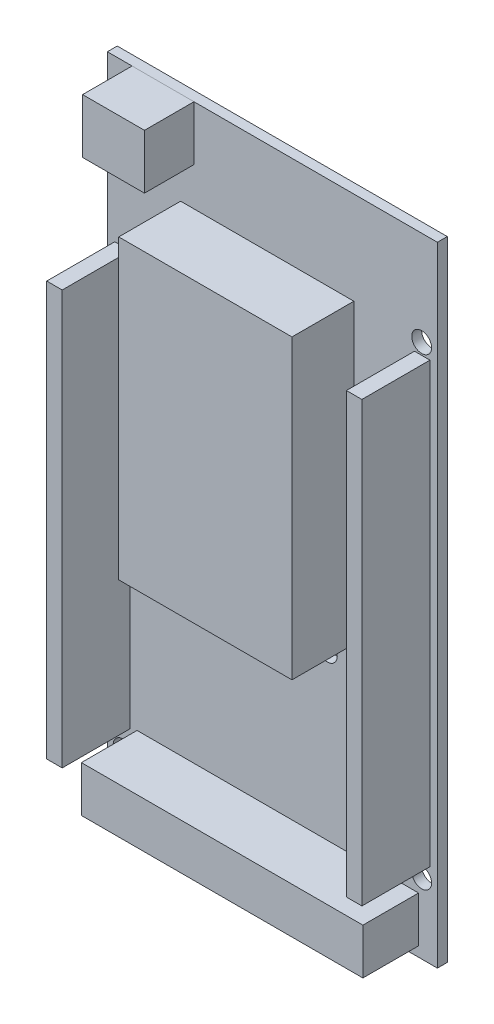
ISO-10303-21;
HEADER;
FILE_DESCRIPTION(('STEP AP214'),'2;1');
FILE_NAME('part.step','',(''),(''),'','','');
FILE_SCHEMA(('AUTOMOTIVE_DESIGN { 1 0 10303 214 1 1 1 1 }'));
ENDSEC;
DATA;
#1=APPLICATION_CONTEXT('core data for automotive mechanical design processes');
#2=APPLICATION_PROTOCOL_DEFINITION('international standard','automotive_design',2000,#1);
#3=PRODUCT_CONTEXT('',#1,'mechanical');
#4=PRODUCT('Part','Part','',(#3));
#5=PRODUCT_RELATED_PRODUCT_CATEGORY('part','',(#4));
#6=PRODUCT_DEFINITION_FORMATION('','',#4);
#7=PRODUCT_DEFINITION_CONTEXT('part definition',#1,'design');
#8=PRODUCT_DEFINITION('design','',#6,#7);
#9=PRODUCT_DEFINITION_SHAPE('','',#8);
#10=(LENGTH_UNIT() NAMED_UNIT(*) SI_UNIT(.MILLI.,.METRE.));
#11=(NAMED_UNIT(*) PLANE_ANGLE_UNIT() SI_UNIT($,.RADIAN.));
#12=(NAMED_UNIT(*) SI_UNIT($,.STERADIAN.) SOLID_ANGLE_UNIT());
#13=UNCERTAINTY_MEASURE_WITH_UNIT(LENGTH_MEASURE(1.E-05),#10,'distance_accuracy_value','');
#14=(GEOMETRIC_REPRESENTATION_CONTEXT(3) GLOBAL_UNCERTAINTY_ASSIGNED_CONTEXT((#13)) GLOBAL_UNIT_ASSIGNED_CONTEXT((#10,
#11,#12)) REPRESENTATION_CONTEXT('',''));
#15=CARTESIAN_POINT('',(0.,0.,0.));
#16=DIRECTION('',(0.,0.,1.));
#17=DIRECTION('',(1.,0.,0.));
#18=AXIS2_PLACEMENT_3D('',#15,#16,#17);
#19=CARTESIAN_POINT('',(-12.67,50.8,9.6));
#20=DIRECTION('',(-1.,0.,0.));
#21=DIRECTION('',(0.,-1.,0.));
#22=AXIS2_PLACEMENT_3D('',#19,#20,#21);
#23=PLANE('',#22);
#24=DIRECTION('',(0.,1.,0.));
#25=VECTOR('',#24,1.);
#26=CARTESIAN_POINT('',(-12.67,50.8,1.6));
#27=LINE('',#26,#25);
#28=CARTESIAN_POINT('',(-12.67,42.,1.6));
#29=VERTEX_POINT('',#28);
#30=CARTESIAN_POINT('',(-12.67,50.8,1.6));
#31=VERTEX_POINT('',#30);
#32=EDGE_CURVE('E106',#29,#31,#27,.T.);
#33=ORIENTED_EDGE('',*,*,#32,.T.);
#34=DIRECTION('',(0.,0.,-1.));
#35=VECTOR('',#34,1.);
#36=CARTESIAN_POINT('',(-12.67,50.8,9.6));
#37=LINE('',#36,#35);
#38=CARTESIAN_POINT('',(-12.67,50.8,9.6));
#39=VERTEX_POINT('',#38);
#40=EDGE_CURVE('E12',#39,#31,#37,.T.);
#41=ORIENTED_EDGE('',*,*,#40,.F.);
#42=DIRECTION('',(0.,1.,0.));
#43=VECTOR('',#42,1.);
#44=CARTESIAN_POINT('',(-12.67,50.8,9.6));
#45=LINE('',#44,#43);
#46=CARTESIAN_POINT('',(-12.67,42.,9.6));
#47=VERTEX_POINT('',#46);
#48=EDGE_CURVE('E94',#47,#39,#45,.T.);
#49=ORIENTED_EDGE('',*,*,#48,.F.);
#50=DIRECTION('',(0.,0.,-1.));
#51=VECTOR('',#50,1.);
#52=CARTESIAN_POINT('',(-12.67,42.,9.6));
#53=LINE('',#52,#51);
#54=EDGE_CURVE('E102',#47,#29,#53,.T.);
#55=ORIENTED_EDGE('',*,*,#54,.T.);
#56=EDGE_LOOP('',(#33,#41,#49,#55));
#57=FACE_BOUND('',#56,.T.);
#58=ADVANCED_FACE('F43',(#57),#23,.F.);
#59=CARTESIAN_POINT('',(-12.67,50.8,9.6));
#60=DIRECTION('',(0.,-1.,0.));
#61=DIRECTION('',(0.,0.,-1.));
#62=AXIS2_PLACEMENT_3D('',#59,#60,#61);
#63=PLANE('',#62);
#64=DIRECTION('',(-1.,0.,0.));
#65=VECTOR('',#64,1.);
#66=CARTESIAN_POINT('',(-12.67,50.8,1.6));
#67=LINE('',#66,#65);
#68=CARTESIAN_POINT('',(-22.67,50.8,1.6));
#69=VERTEX_POINT('',#68);
#70=EDGE_CURVE('E98',#31,#69,#67,.T.);
#71=ORIENTED_EDGE('',*,*,#70,.T.);
#72=DIRECTION('',(0.,0.,-1.));
#73=VECTOR('',#72,1.);
#74=CARTESIAN_POINT('',(-22.67,50.8,9.6));
#75=LINE('',#74,#73);
#76=CARTESIAN_POINT('',(-22.67,50.8,9.6));
#77=VERTEX_POINT('',#76);
#78=EDGE_CURVE('E51',#77,#69,#75,.T.);
#79=ORIENTED_EDGE('',*,*,#78,.F.);
#80=DIRECTION('',(-1.,0.,0.));
#81=VECTOR('',#80,1.);
#82=CARTESIAN_POINT('',(-12.67,50.8,9.6));
#83=LINE('',#82,#81);
#84=EDGE_CURVE('E89',#39,#77,#83,.T.);
#85=ORIENTED_EDGE('',*,*,#84,.F.);
#86=ORIENTED_EDGE('',*,*,#40,.T.);
#87=EDGE_LOOP('',(#71,#79,#85,#86));
#88=FACE_BOUND('',#87,.T.);
#89=ADVANCED_FACE('F97',(#88),#63,.F.);
#90=CARTESIAN_POINT('',(-22.67,50.8,9.6));
#91=DIRECTION('',(1.,0.,0.));
#92=DIRECTION('',(0.,0.,-1.));
#93=AXIS2_PLACEMENT_3D('',#90,#91,#92);
#94=PLANE('',#93);
#95=DIRECTION('',(0.,-1.,0.));
#96=VECTOR('',#95,1.);
#97=CARTESIAN_POINT('',(-22.67,50.8,1.6));
#98=LINE('',#97,#96);
#99=CARTESIAN_POINT('',(-22.67,42.,1.6));
#100=VERTEX_POINT('',#99);
#101=EDGE_CURVE('E76',#69,#100,#98,.T.);
#102=ORIENTED_EDGE('',*,*,#101,.T.);
#103=DIRECTION('',(0.,0.,-1.));
#104=VECTOR('',#103,1.);
#105=CARTESIAN_POINT('',(-22.67,42.,9.6));
#106=LINE('',#105,#104);
#107=CARTESIAN_POINT('',(-22.67,42.,9.6));
#108=VERTEX_POINT('',#107);
#109=EDGE_CURVE('E99',#108,#100,#106,.T.);
#110=ORIENTED_EDGE('',*,*,#109,.F.);
#111=DIRECTION('',(0.,-1.,0.));
#112=VECTOR('',#111,1.);
#113=CARTESIAN_POINT('',(-22.67,50.8,9.6));
#114=LINE('',#113,#112);
#115=EDGE_CURVE('E92',#77,#108,#114,.T.);
#116=ORIENTED_EDGE('',*,*,#115,.F.);
#117=ORIENTED_EDGE('',*,*,#78,.T.);
#118=EDGE_LOOP('',(#102,#110,#116,#117));
#119=FACE_BOUND('',#118,.T.);
#120=ADVANCED_FACE('F100',(#119),#94,.F.);
#121=CARTESIAN_POINT('',(-12.67,42.,9.6));
#122=DIRECTION('',(0.,1.,0.));
#123=DIRECTION('',(0.,0.,1.));
#124=AXIS2_PLACEMENT_3D('',#121,#122,#123);
#125=PLANE('',#124);
#126=DIRECTION('',(1.,0.,0.));
#127=VECTOR('',#126,1.);
#128=CARTESIAN_POINT('',(-12.67,42.,1.6));
#129=LINE('',#128,#127);
#130=EDGE_CURVE('E82',#100,#29,#129,.T.);
#131=ORIENTED_EDGE('',*,*,#130,.T.);
#132=ORIENTED_EDGE('',*,*,#54,.F.);
#133=DIRECTION('',(1.,0.,0.));
#134=VECTOR('',#133,1.);
#135=CARTESIAN_POINT('',(-12.67,42.,9.6));
#136=LINE('',#135,#134);
#137=EDGE_CURVE('E59',#108,#47,#136,.T.);
#138=ORIENTED_EDGE('',*,*,#137,.F.);
#139=ORIENTED_EDGE('',*,*,#109,.T.);
#140=EDGE_LOOP('',(#131,#132,#138,#139));
#141=FACE_BOUND('',#140,.T.);
#142=ADVANCED_FACE('F113',(#141),#125,.F.);
#143=CARTESIAN_POINT('',(0.,0.,9.6));
#144=DIRECTION('',(0.,0.,-1.));
#145=DIRECTION('',(-1.,0.,0.));
#146=AXIS2_PLACEMENT_3D('',#143,#144,#145);
#147=PLANE('',#146);
#148=ORIENTED_EDGE('',*,*,#48,.T.);
#149=ORIENTED_EDGE('',*,*,#84,.T.);
#150=ORIENTED_EDGE('',*,*,#115,.T.);
#151=ORIENTED_EDGE('',*,*,#137,.T.);
#152=EDGE_LOOP('',(#148,#149,#150,#151));
#153=FACE_BOUND('',#152,.T.);
#154=ADVANCED_FACE('F90',(#153),#147,.F.);
#155=CARTESIAN_POINT('',(0.,0.,1.6));
#156=DIRECTION('',(0.,0.,-1.));
#157=DIRECTION('',(-1.,0.,0.));
#158=AXIS2_PLACEMENT_3D('',#155,#156,#157);
#159=PLANE('',#158);
#160=ORIENTED_EDGE('',*,*,#32,.F.);
#161=ORIENTED_EDGE('',*,*,#130,.F.);
#162=ORIENTED_EDGE('',*,*,#101,.F.);
#163=ORIENTED_EDGE('',*,*,#70,.F.);
#164=EDGE_LOOP('',(#160,#161,#162,#163));
#165=FACE_BOUND('',#164,.T.);
#166=ADVANCED_FACE('F116',(#165),#159,.T.);
#167=CLOSED_SHELL('',(#58,#89,#120,#142,#154,#166));
#168=MANIFOLD_SOLID_BREP('B2',#167);
#169=CARTESIAN_POINT('',(0.,0.,1.6));
#170=DIRECTION('',(0.,0.,1.));
#171=DIRECTION('',(1.,0.,0.));
#172=AXIS2_PLACEMENT_3D('',#169,#170,#171);
#173=PLANE('',#172);
#174=CARTESIAN_POINT('',(24.13,-39.37,1.6));
#175=DIRECTION('',(0.,0.,1.));
#176=DIRECTION('',(1.,0.,0.));
#177=AXIS2_PLACEMENT_3D('',#174,#175,#176);
#178=CIRCLE('',#177,1.59999999999999);
#179=CARTESIAN_POINT('',(25.73,-39.37,1.6));
#180=VERTEX_POINT('',#179);
#181=EDGE_CURVE('E330',#180,#180,#178,.T.);
#182=ORIENTED_EDGE('',*,*,#181,.F.);
#183=EDGE_LOOP('',(#182));
#184=FACE_BOUND('',#183,.T.);
#185=CARTESIAN_POINT('',(-24.13,-45.72,1.6));
#186=DIRECTION('',(0.,0.,1.));
#187=DIRECTION('',(1.,0.,0.));
#188=AXIS2_PLACEMENT_3D('',#185,#186,#187);
#189=CIRCLE('',#188,1.59999999999999);
#190=CARTESIAN_POINT('',(-22.53,-45.72,1.6));
#191=VERTEX_POINT('',#190);
#192=EDGE_CURVE('E340',#191,#191,#189,.T.);
#193=ORIENTED_EDGE('',*,*,#192,.F.);
#194=EDGE_LOOP('',(#193));
#195=FACE_BOUND('',#194,.T.);
#196=CARTESIAN_POINT('',(-19.05,-15.24,1.6));
#197=DIRECTION('',(0.,0.,1.));
#198=DIRECTION('',(1.,0.,0.));
#199=AXIS2_PLACEMENT_3D('',#196,#197,#198);
#200=CIRCLE('',#199,1.59999999999999);
#201=CARTESIAN_POINT('',(-17.45,-15.24,1.6));
#202=VERTEX_POINT('',#201);
#203=EDGE_CURVE('E346',#202,#202,#200,.T.);
#204=ORIENTED_EDGE('',*,*,#203,.F.);
#205=EDGE_LOOP('',(#204));
#206=FACE_BOUND('',#205,.T.);
#207=CARTESIAN_POINT('',(8.89000000000001,-15.24,1.6));
#208=DIRECTION('',(0.,0.,1.));
#209=DIRECTION('',(1.,0.,0.));
#210=AXIS2_PLACEMENT_3D('',#207,#208,#209);
#211=CIRCLE('',#210,1.59999999999999);
#212=CARTESIAN_POINT('',(10.49,-15.24,1.6));
#213=VERTEX_POINT('',#212);
#214=EDGE_CURVE('E352',#213,#213,#211,.T.);
#215=ORIENTED_EDGE('',*,*,#214,.F.);
#216=EDGE_LOOP('',(#215));
#217=FACE_BOUND('',#216,.T.);
#218=CARTESIAN_POINT('',(-24.13,36.83,1.6));
#219=DIRECTION('',(0.,0.,1.));
#220=DIRECTION('',(1.,0.,0.));
#221=AXIS2_PLACEMENT_3D('',#218,#219,#220);
#222=CIRCLE('',#221,1.59999999999999);
#223=CARTESIAN_POINT('',(-22.53,36.83,1.6));
#224=VERTEX_POINT('',#223);
#225=EDGE_CURVE('E358',#224,#224,#222,.T.);
#226=ORIENTED_EDGE('',*,*,#225,.F.);
#227=EDGE_LOOP('',(#226));
#228=FACE_BOUND('',#227,.T.);
#229=CARTESIAN_POINT('',(24.13,35.56,1.6));
#230=DIRECTION('',(0.,0.,1.));
#231=DIRECTION('',(1.,0.,0.));
#232=AXIS2_PLACEMENT_3D('',#229,#230,#231);
#233=CIRCLE('',#232,1.59999999999999);
#234=CARTESIAN_POINT('',(25.73,35.56,1.6));
#235=VERTEX_POINT('',#234);
#236=EDGE_CURVE('E364',#235,#235,#233,.T.);
#237=ORIENTED_EDGE('',*,*,#236,.F.);
#238=EDGE_LOOP('',(#237));
#239=FACE_BOUND('',#238,.T.);
#240=DIRECTION('',(0.,-1.,0.));
#241=VECTOR('',#240,1.);
#242=CARTESIAN_POINT('',(-26.67,-50.8,1.6));
#243=LINE('',#242,#241);
#244=CARTESIAN_POINT('',(-26.67,50.8,1.6));
#245=VERTEX_POINT('',#244);
#246=CARTESIAN_POINT('',(-26.67,-50.8,1.6));
#247=VERTEX_POINT('',#246);
#248=EDGE_CURVE('E456',#245,#247,#243,.T.);
#249=ORIENTED_EDGE('',*,*,#248,.T.);
#250=DIRECTION('',(1.,0.,0.));
#251=VECTOR('',#250,1.);
#252=CARTESIAN_POINT('',(26.67,-50.8,1.6));
#253=LINE('',#252,#251);
#254=CARTESIAN_POINT('',(26.67,-50.8,1.6));
#255=VERTEX_POINT('',#254);
#256=EDGE_CURVE('E459',#247,#255,#253,.T.);
#257=ORIENTED_EDGE('',*,*,#256,.T.);
#258=DIRECTION('',(0.,1.,0.));
#259=VECTOR('',#258,1.);
#260=CARTESIAN_POINT('',(26.67,-50.8,1.6));
#261=LINE('',#260,#259);
#262=CARTESIAN_POINT('',(26.67,50.8,1.6));
#263=VERTEX_POINT('',#262);
#264=EDGE_CURVE('E462',#255,#263,#261,.T.);
#265=ORIENTED_EDGE('',*,*,#264,.T.);
#266=DIRECTION('',(-1.,0.,0.));
#267=VECTOR('',#266,1.);
#268=CARTESIAN_POINT('',(26.67,50.8,1.6));
#269=LINE('',#268,#267);
#270=EDGE_CURVE('E464',#263,#245,#269,.T.);
#271=ORIENTED_EDGE('',*,*,#270,.T.);
#272=EDGE_LOOP('',(#249,#257,#265,#271));
#273=FACE_BOUND('',#272,.T.);
#274=DIRECTION('',(1.,0.,0.));
#275=VECTOR('',#274,1.);
#276=CARTESIAN_POINT('',(-25.47,-42.1,1.6));
#277=LINE('',#276,#275);
#278=CARTESIAN_POINT('',(-25.47,-42.1,1.6));
#279=VERTEX_POINT('',#278);
#280=CARTESIAN_POINT('',(-22.97,-42.1,1.6));
#281=VERTEX_POINT('',#280);
#282=EDGE_CURVE('E440',#279,#281,#277,.T.);
#283=ORIENTED_EDGE('',*,*,#282,.F.);
#284=DIRECTION('',(0.,-1.,0.));
#285=VECTOR('',#284,1.);
#286=CARTESIAN_POINT('',(-25.47,24.8,1.6));
#287=LINE('',#286,#285);
#288=CARTESIAN_POINT('',(-25.47,24.8,1.6));
#289=VERTEX_POINT('',#288);
#290=EDGE_CURVE('E426',#289,#279,#287,.T.);
#291=ORIENTED_EDGE('',*,*,#290,.F.);
#292=DIRECTION('',(-1.,0.,0.));
#293=VECTOR('',#292,1.);
#294=CARTESIAN_POINT('',(-25.47,24.8,1.6));
#295=LINE('',#294,#293);
#296=CARTESIAN_POINT('',(-22.97,24.8,1.6));
#297=VERTEX_POINT('',#296);
#298=EDGE_CURVE('E431',#297,#289,#295,.T.);
#299=ORIENTED_EDGE('',*,*,#298,.F.);
#300=DIRECTION('',(0.,1.,0.));
#301=VECTOR('',#300,1.);
#302=CARTESIAN_POINT('',(-22.97,24.8,1.6));
#303=LINE('',#302,#301);
#304=EDGE_CURVE('E442',#281,#297,#303,.T.);
#305=ORIENTED_EDGE('',*,*,#304,.F.);
#306=EDGE_LOOP('',(#283,#291,#299,#305));
#307=FACE_BOUND('',#306,.T.);
#308=DIRECTION('',(-1.,0.,0.));
#309=VECTOR('',#308,1.);
#310=CARTESIAN_POINT('',(25.47,33.7,1.6));
#311=LINE('',#310,#309);
#312=CARTESIAN_POINT('',(25.47,33.7,1.6));
#313=VERTEX_POINT('',#312);
#314=CARTESIAN_POINT('',(22.97,33.7,1.6));
#315=VERTEX_POINT('',#314);
#316=EDGE_CURVE('E411',#313,#315,#311,.T.);
#317=ORIENTED_EDGE('',*,*,#316,.F.);
#318=DIRECTION('',(0.,1.,0.));
#319=VECTOR('',#318,1.);
#320=CARTESIAN_POINT('',(25.47,33.7,1.6));
#321=LINE('',#320,#319);
#322=CARTESIAN_POINT('',(25.47,-37.2,1.6));
#323=VERTEX_POINT('',#322);
#324=EDGE_CURVE('E397',#323,#313,#321,.T.);
#325=ORIENTED_EDGE('',*,*,#324,.F.);
#326=DIRECTION('',(1.,0.,0.));
#327=VECTOR('',#326,1.);
#328=CARTESIAN_POINT('',(25.47,-37.2,1.6));
#329=LINE('',#328,#327);
#330=CARTESIAN_POINT('',(22.97,-37.2,1.6));
#331=VERTEX_POINT('',#330);
#332=EDGE_CURVE('E402',#331,#323,#329,.T.);
#333=ORIENTED_EDGE('',*,*,#332,.F.);
#334=DIRECTION('',(0.,-1.,0.));
#335=VECTOR('',#334,1.);
#336=CARTESIAN_POINT('',(22.97,33.7,1.6));
#337=LINE('',#336,#335);
#338=EDGE_CURVE('E413',#315,#331,#337,.T.);
#339=ORIENTED_EDGE('',*,*,#338,.F.);
#340=EDGE_LOOP('',(#317,#325,#333,#339));
#341=FACE_BOUND('',#340,.T.);
#342=DIRECTION('',(1.,0.,0.));
#343=VECTOR('',#342,1.);
#344=CARTESIAN_POINT('',(-21.87,-49.2,1.6));
#345=LINE('',#344,#343);
#346=CARTESIAN_POINT('',(-21.87,-49.2,1.6));
#347=VERTEX_POINT('',#346);
#348=CARTESIAN_POINT('',(23.63,-49.2,1.6));
#349=VERTEX_POINT('',#348);
#350=EDGE_CURVE('E384',#347,#349,#345,.T.);
#351=ORIENTED_EDGE('',*,*,#350,.F.);
#352=DIRECTION('',(0.,-1.,0.));
#353=VECTOR('',#352,1.);
#354=CARTESIAN_POINT('',(-21.87,-41.8,1.6));
#355=LINE('',#354,#353);
#356=CARTESIAN_POINT('',(-21.87,-41.8,1.6));
#357=VERTEX_POINT('',#356);
#358=EDGE_CURVE('E370',#357,#347,#355,.T.);
#359=ORIENTED_EDGE('',*,*,#358,.F.);
#360=DIRECTION('',(-1.,0.,0.));
#361=VECTOR('',#360,1.);
#362=CARTESIAN_POINT('',(-21.87,-41.8,1.6));
#363=LINE('',#362,#361);
#364=CARTESIAN_POINT('',(23.63,-41.8,1.6));
#365=VERTEX_POINT('',#364);
#366=EDGE_CURVE('E375',#365,#357,#363,.T.);
#367=ORIENTED_EDGE('',*,*,#366,.F.);
#368=DIRECTION('',(0.,1.,0.));
#369=VECTOR('',#368,1.);
#370=CARTESIAN_POINT('',(23.63,-41.8,1.6));
#371=LINE('',#370,#369);
#372=EDGE_CURVE('E386',#349,#365,#371,.T.);
#373=ORIENTED_EDGE('',*,*,#372,.F.);
#374=EDGE_LOOP('',(#351,#359,#367,#373));
#375=FACE_BOUND('',#374,.T.);
#376=DIRECTION('',(1.,0.,0.));
#377=VECTOR('',#376,1.);
#378=CARTESIAN_POINT('',(-14.83,-12.2,1.6));
#379=LINE('',#378,#377);
#380=CARTESIAN_POINT('',(-14.83,-12.2,1.6));
#381=VERTEX_POINT('',#380);
#382=CARTESIAN_POINT('',(13.17,-12.2,1.6));
#383=VERTEX_POINT('',#382);
#384=EDGE_CURVE('E809',#381,#383,#379,.T.);
#385=ORIENTED_EDGE('',*,*,#384,.F.);
#386=DIRECTION('',(0.,-1.,0.));
#387=VECTOR('',#386,1.);
#388=CARTESIAN_POINT('',(-14.83,35.8,1.6));
#389=LINE('',#388,#387);
#390=CARTESIAN_POINT('',(-14.83,35.8,1.6));
#391=VERTEX_POINT('',#390);
#392=EDGE_CURVE('E328',#391,#381,#389,.T.);
#393=ORIENTED_EDGE('',*,*,#392,.F.);
#394=DIRECTION('',(-1.,0.,0.));
#395=VECTOR('',#394,1.);
#396=CARTESIAN_POINT('',(-14.83,35.8,1.6));
#397=LINE('',#396,#395);
#398=CARTESIAN_POINT('',(13.17,35.8,1.6));
#399=VERTEX_POINT('',#398);
#400=EDGE_CURVE('E324',#399,#391,#397,.T.);
#401=ORIENTED_EDGE('',*,*,#400,.F.);
#402=DIRECTION('',(0.,1.,0.));
#403=VECTOR('',#402,1.);
#404=CARTESIAN_POINT('',(13.17,35.8,1.6));
#405=LINE('',#404,#403);
#406=EDGE_CURVE('E806',#383,#399,#405,.T.);
#407=ORIENTED_EDGE('',*,*,#406,.F.);
#408=EDGE_LOOP('',(#385,#393,#401,#407));
#409=FACE_BOUND('',#408,.T.);
#410=ADVANCED_FACE('F167',(#184,#195,#206,#217,#228,#239,#273,#307,#341,#375,#409),#173,.T.);
#411=CARTESIAN_POINT('',(-26.67,-50.8,1.6));
#412=DIRECTION('',(1.,0.,0.));
#413=DIRECTION('',(0.,0.,-1.));
#414=AXIS2_PLACEMENT_3D('',#411,#412,#413);
#415=PLANE('',#414);
#416=DIRECTION('',(0.,-1.,0.));
#417=VECTOR('',#416,1.);
#418=CARTESIAN_POINT('',(-26.67,-50.8,0.));
#419=LINE('',#418,#417);
#420=CARTESIAN_POINT('',(-26.67,50.8,0.));
#421=VERTEX_POINT('',#420);
#422=CARTESIAN_POINT('',(-26.67,-50.8,0.));
#423=VERTEX_POINT('',#422);
#424=EDGE_CURVE('E455',#421,#423,#419,.T.);
#425=ORIENTED_EDGE('',*,*,#424,.T.);
#426=DIRECTION('',(0.,0.,-1.));
#427=VECTOR('',#426,1.);
#428=CARTESIAN_POINT('',(-26.67,-50.8,1.6));
#429=LINE('',#428,#427);
#430=EDGE_CURVE('E41',#247,#423,#429,.T.);
#431=ORIENTED_EDGE('',*,*,#430,.F.);
#432=ORIENTED_EDGE('',*,*,#248,.F.);
#433=DIRECTION('',(0.,0.,-1.));
#434=VECTOR('',#433,1.);
#435=CARTESIAN_POINT('',(-26.67,50.8,1.6));
#436=LINE('',#435,#434);
#437=EDGE_CURVE('E466',#245,#421,#436,.T.);
#438=ORIENTED_EDGE('',*,*,#437,.T.);
#439=EDGE_LOOP('',(#425,#431,#432,#438));
#440=FACE_BOUND('',#439,.T.);
#441=ADVANCED_FACE('F169',(#440),#415,.F.);
#442=CARTESIAN_POINT('',(26.67,-50.8,1.6));
#443=DIRECTION('',(0.,1.,0.));
#444=DIRECTION('',(-1.,0.,0.));
#445=AXIS2_PLACEMENT_3D('',#442,#443,#444);
#446=PLANE('',#445);
#447=DIRECTION('',(1.,0.,0.));
#448=VECTOR('',#447,1.);
#449=CARTESIAN_POINT('',(26.67,-50.8,0.));
#450=LINE('',#449,#448);
#451=CARTESIAN_POINT('',(26.67,-50.8,0.));
#452=VERTEX_POINT('',#451);
#453=EDGE_CURVE('E469',#423,#452,#450,.T.);
#454=ORIENTED_EDGE('',*,*,#453,.T.);
#455=DIRECTION('',(0.,0.,-1.));
#456=VECTOR('',#455,1.);
#457=CARTESIAN_POINT('',(26.67,-50.8,1.6));
#458=LINE('',#457,#456);
#459=EDGE_CURVE('E175',#255,#452,#458,.T.);
#460=ORIENTED_EDGE('',*,*,#459,.F.);
#461=ORIENTED_EDGE('',*,*,#256,.F.);
#462=ORIENTED_EDGE('',*,*,#430,.T.);
#463=EDGE_LOOP('',(#454,#460,#461,#462));
#464=FACE_BOUND('',#463,.T.);
#465=ADVANCED_FACE('F499',(#464),#446,.F.);
#466=CARTESIAN_POINT('',(26.67,-50.8,1.6));
#467=DIRECTION('',(-1.,0.,0.));
#468=DIRECTION('',(0.,0.,1.));
#469=AXIS2_PLACEMENT_3D('',#466,#467,#468);
#470=PLANE('',#469);
#471=DIRECTION('',(0.,1.,0.));
#472=VECTOR('',#471,1.);
#473=CARTESIAN_POINT('',(26.67,-50.8,0.));
#474=LINE('',#473,#472);
#475=CARTESIAN_POINT('',(26.67,50.8,0.));
#476=VERTEX_POINT('',#475);
#477=EDGE_CURVE('E471',#452,#476,#474,.T.);
#478=ORIENTED_EDGE('',*,*,#477,.T.);
#479=DIRECTION('',(0.,0.,-1.));
#480=VECTOR('',#479,1.);
#481=CARTESIAN_POINT('',(26.67,50.8,1.6));
#482=LINE('',#481,#480);
#483=EDGE_CURVE('E476',#263,#476,#482,.T.);
#484=ORIENTED_EDGE('',*,*,#483,.F.);
#485=ORIENTED_EDGE('',*,*,#264,.F.);
#486=ORIENTED_EDGE('',*,*,#459,.T.);
#487=EDGE_LOOP('',(#478,#484,#485,#486));
#488=FACE_BOUND('',#487,.T.);
#489=ADVANCED_FACE('F483',(#488),#470,.F.);
#490=CARTESIAN_POINT('',(26.67,50.8,1.6));
#491=DIRECTION('',(0.,-1.,0.));
#492=DIRECTION('',(0.,0.,-1.));
#493=AXIS2_PLACEMENT_3D('',#490,#491,#492);
#494=PLANE('',#493);
#495=DIRECTION('',(-1.,0.,0.));
#496=VECTOR('',#495,1.);
#497=CARTESIAN_POINT('',(26.67,50.8,0.));
#498=LINE('',#497,#496);
#499=EDGE_CURVE('E460',#476,#421,#498,.T.);
#500=ORIENTED_EDGE('',*,*,#499,.T.);
#501=ORIENTED_EDGE('',*,*,#437,.F.);
#502=ORIENTED_EDGE('',*,*,#270,.F.);
#503=ORIENTED_EDGE('',*,*,#483,.T.);
#504=EDGE_LOOP('',(#500,#501,#502,#503));
#505=FACE_BOUND('',#504,.T.);
#506=ADVANCED_FACE('F492',(#505),#494,.F.);
#507=CARTESIAN_POINT('',(0.,0.,0.));
#508=DIRECTION('',(0.,0.,1.));
#509=DIRECTION('',(1.,0.,0.));
#510=AXIS2_PLACEMENT_3D('',#507,#508,#509);
#511=PLANE('',#510);
#512=CARTESIAN_POINT('',(24.13,-39.37,0.));
#513=DIRECTION('',(0.,0.,1.));
#514=DIRECTION('',(1.,0.,0.));
#515=AXIS2_PLACEMENT_3D('',#512,#513,#514);
#516=CIRCLE('',#515,1.59999999999999);
#517=CARTESIAN_POINT('',(25.73,-39.37,0.));
#518=VERTEX_POINT('',#517);
#519=EDGE_CURVE('E333',#518,#518,#516,.T.);
#520=ORIENTED_EDGE('',*,*,#519,.T.);
#521=EDGE_LOOP('',(#520));
#522=FACE_BOUND('',#521,.T.);
#523=CARTESIAN_POINT('',(-24.13,-45.72,0.));
#524=DIRECTION('',(0.,0.,1.));
#525=DIRECTION('',(1.,0.,0.));
#526=AXIS2_PLACEMENT_3D('',#523,#524,#525);
#527=CIRCLE('',#526,1.59999999999999);
#528=CARTESIAN_POINT('',(-22.53,-45.72,0.));
#529=VERTEX_POINT('',#528);
#530=EDGE_CURVE('E343',#529,#529,#527,.T.);
#531=ORIENTED_EDGE('',*,*,#530,.T.);
#532=EDGE_LOOP('',(#531));
#533=FACE_BOUND('',#532,.T.);
#534=CARTESIAN_POINT('',(-19.05,-15.24,0.));
#535=DIRECTION('',(0.,0.,1.));
#536=DIRECTION('',(1.,0.,0.));
#537=AXIS2_PLACEMENT_3D('',#534,#535,#536);
#538=CIRCLE('',#537,1.59999999999999);
#539=CARTESIAN_POINT('',(-17.45,-15.24,0.));
#540=VERTEX_POINT('',#539);
#541=EDGE_CURVE('E349',#540,#540,#538,.T.);
#542=ORIENTED_EDGE('',*,*,#541,.T.);
#543=EDGE_LOOP('',(#542));
#544=FACE_BOUND('',#543,.T.);
#545=CARTESIAN_POINT('',(8.89000000000001,-15.24,0.));
#546=DIRECTION('',(0.,0.,1.));
#547=DIRECTION('',(1.,0.,0.));
#548=AXIS2_PLACEMENT_3D('',#545,#546,#547);
#549=CIRCLE('',#548,1.59999999999999);
#550=CARTESIAN_POINT('',(10.49,-15.24,0.));
#551=VERTEX_POINT('',#550);
#552=EDGE_CURVE('E355',#551,#551,#549,.T.);
#553=ORIENTED_EDGE('',*,*,#552,.T.);
#554=EDGE_LOOP('',(#553));
#555=FACE_BOUND('',#554,.T.);
#556=CARTESIAN_POINT('',(-24.13,36.83,0.));
#557=DIRECTION('',(0.,0.,1.));
#558=DIRECTION('',(1.,0.,0.));
#559=AXIS2_PLACEMENT_3D('',#556,#557,#558);
#560=CIRCLE('',#559,1.59999999999999);
#561=CARTESIAN_POINT('',(-22.53,36.83,0.));
#562=VERTEX_POINT('',#561);
#563=EDGE_CURVE('E361',#562,#562,#560,.T.);
#564=ORIENTED_EDGE('',*,*,#563,.T.);
#565=EDGE_LOOP('',(#564));
#566=FACE_BOUND('',#565,.T.);
#567=CARTESIAN_POINT('',(24.13,35.56,0.));
#568=DIRECTION('',(0.,0.,1.));
#569=DIRECTION('',(1.,0.,0.));
#570=AXIS2_PLACEMENT_3D('',#567,#568,#569);
#571=CIRCLE('',#570,1.59999999999999);
#572=CARTESIAN_POINT('',(25.73,35.56,0.));
#573=VERTEX_POINT('',#572);
#574=EDGE_CURVE('E367',#573,#573,#571,.T.);
#575=ORIENTED_EDGE('',*,*,#574,.T.);
#576=EDGE_LOOP('',(#575));
#577=FACE_BOUND('',#576,.T.);
#578=ORIENTED_EDGE('',*,*,#424,.F.);
#579=ORIENTED_EDGE('',*,*,#499,.F.);
#580=ORIENTED_EDGE('',*,*,#477,.F.);
#581=ORIENTED_EDGE('',*,*,#453,.F.);
#582=EDGE_LOOP('',(#578,#579,#580,#581));
#583=FACE_BOUND('',#582,.T.);
#584=ADVANCED_FACE('F489',(#522,#533,#544,#555,#566,#577,#583),#511,.F.);
#585=CARTESIAN_POINT('',(-25.47,24.8,12.6));
#586=DIRECTION('',(1.,0.,0.));
#587=DIRECTION('',(0.,1.,0.));
#588=AXIS2_PLACEMENT_3D('',#585,#586,#587);
#589=PLANE('',#588);
#590=ORIENTED_EDGE('',*,*,#290,.T.);
#591=DIRECTION('',(0.,0.,-1.));
#592=VECTOR('',#591,1.);
#593=CARTESIAN_POINT('',(-25.47,-42.1,12.6));
#594=LINE('',#593,#592);
#595=CARTESIAN_POINT('',(-25.47,-42.1,12.6));
#596=VERTEX_POINT('',#595);
#597=EDGE_CURVE('E453',#596,#279,#594,.T.);
#598=ORIENTED_EDGE('',*,*,#597,.F.);
#599=DIRECTION('',(0.,-1.,0.));
#600=VECTOR('',#599,1.);
#601=CARTESIAN_POINT('',(-25.47,24.8,12.6));
#602=LINE('',#601,#600);
#603=CARTESIAN_POINT('',(-25.47,24.8,12.6));
#604=VERTEX_POINT('',#603);
#605=EDGE_CURVE('E427',#604,#596,#602,.T.);
#606=ORIENTED_EDGE('',*,*,#605,.F.);
#607=DIRECTION('',(0.,0.,-1.));
#608=VECTOR('',#607,1.);
#609=CARTESIAN_POINT('',(-25.47,24.8,12.6));
#610=LINE('',#609,#608);
#611=EDGE_CURVE('E437',#604,#289,#610,.T.);
#612=ORIENTED_EDGE('',*,*,#611,.T.);
#613=EDGE_LOOP('',(#590,#598,#606,#612));
#614=FACE_BOUND('',#613,.T.);
#615=ADVANCED_FACE('F515',(#614),#589,.F.);
#616=CARTESIAN_POINT('',(-25.47,-42.1,12.6));
#617=DIRECTION('',(0.,1.,0.));
#618=DIRECTION('',(-1.,0.,0.));
#619=AXIS2_PLACEMENT_3D('',#616,#617,#618);
#620=PLANE('',#619);
#621=ORIENTED_EDGE('',*,*,#282,.T.);
#622=DIRECTION('',(0.,0.,-1.));
#623=VECTOR('',#622,1.);
#624=CARTESIAN_POINT('',(-22.97,-42.1,12.6));
#625=LINE('',#624,#623);
#626=CARTESIAN_POINT('',(-22.97,-42.1,12.6));
#627=VERTEX_POINT('',#626);
#628=EDGE_CURVE('E450',#627,#281,#625,.T.);
#629=ORIENTED_EDGE('',*,*,#628,.F.);
#630=DIRECTION('',(1.,0.,0.));
#631=VECTOR('',#630,1.);
#632=CARTESIAN_POINT('',(-25.47,-42.1,12.6));
#633=LINE('',#632,#631);
#634=EDGE_CURVE('E430',#596,#627,#633,.T.);
#635=ORIENTED_EDGE('',*,*,#634,.F.);
#636=ORIENTED_EDGE('',*,*,#597,.T.);
#637=EDGE_LOOP('',(#621,#629,#635,#636));
#638=FACE_BOUND('',#637,.T.);
#639=ADVANCED_FACE('F537',(#638),#620,.F.);
#640=CARTESIAN_POINT('',(-22.97,24.8,12.6));
#641=DIRECTION('',(-1.,0.,0.));
#642=DIRECTION('',(0.,-1.,0.));
#643=AXIS2_PLACEMENT_3D('',#640,#641,#642);
#644=PLANE('',#643);
#645=ORIENTED_EDGE('',*,*,#304,.T.);
#646=DIRECTION('',(0.,0.,-1.));
#647=VECTOR('',#646,1.);
#648=CARTESIAN_POINT('',(-22.97,24.8,12.6));
#649=LINE('',#648,#647);
#650=CARTESIAN_POINT('',(-22.97,24.8,12.6));
#651=VERTEX_POINT('',#650);
#652=EDGE_CURVE('E448',#651,#297,#649,.T.);
#653=ORIENTED_EDGE('',*,*,#652,.F.);
#654=DIRECTION('',(0.,1.,0.));
#655=VECTOR('',#654,1.);
#656=CARTESIAN_POINT('',(-22.97,24.8,12.6));
#657=LINE('',#656,#655);
#658=EDGE_CURVE('E433',#627,#651,#657,.T.);
#659=ORIENTED_EDGE('',*,*,#658,.F.);
#660=ORIENTED_EDGE('',*,*,#628,.T.);
#661=EDGE_LOOP('',(#645,#653,#659,#660));
#662=FACE_BOUND('',#661,.T.);
#663=ADVANCED_FACE('F544',(#662),#644,.F.);
#664=CARTESIAN_POINT('',(-25.47,24.8,12.6));
#665=DIRECTION('',(0.,-1.,0.));
#666=DIRECTION('',(1.,0.,0.));
#667=AXIS2_PLACEMENT_3D('',#664,#665,#666);
#668=PLANE('',#667);
#669=ORIENTED_EDGE('',*,*,#298,.T.);
#670=ORIENTED_EDGE('',*,*,#611,.F.);
#671=DIRECTION('',(-1.,0.,0.));
#672=VECTOR('',#671,1.);
#673=CARTESIAN_POINT('',(-25.47,24.8,12.6));
#674=LINE('',#673,#672);
#675=EDGE_CURVE('E435',#651,#604,#674,.T.);
#676=ORIENTED_EDGE('',*,*,#675,.F.);
#677=ORIENTED_EDGE('',*,*,#652,.T.);
#678=EDGE_LOOP('',(#669,#670,#676,#677));
#679=FACE_BOUND('',#678,.T.);
#680=ADVANCED_FACE('F551',(#679),#668,.F.);
#681=CARTESIAN_POINT('',(0.,0.,12.6));
#682=DIRECTION('',(0.,0.,1.));
#683=DIRECTION('',(1.,0.,0.));
#684=AXIS2_PLACEMENT_3D('',#681,#682,#683);
#685=PLANE('',#684);
#686=ORIENTED_EDGE('',*,*,#605,.T.);
#687=ORIENTED_EDGE('',*,*,#634,.T.);
#688=ORIENTED_EDGE('',*,*,#658,.T.);
#689=ORIENTED_EDGE('',*,*,#675,.T.);
#690=EDGE_LOOP('',(#686,#687,#688,#689));
#691=FACE_BOUND('',#690,.T.);
#692=ADVANCED_FACE('F559',(#691),#685,.T.);
#693=CARTESIAN_POINT('',(25.47,33.7,12.6));
#694=DIRECTION('',(-1.,0.,0.));
#695=DIRECTION('',(0.,-1.,0.));
#696=AXIS2_PLACEMENT_3D('',#693,#694,#695);
#697=PLANE('',#696);
#698=ORIENTED_EDGE('',*,*,#324,.T.);
#699=DIRECTION('',(0.,0.,-1.));
#700=VECTOR('',#699,1.);
#701=CARTESIAN_POINT('',(25.47,33.7,12.6));
#702=LINE('',#701,#700);
#703=CARTESIAN_POINT('',(25.47,33.7,12.6));
#704=VERTEX_POINT('',#703);
#705=EDGE_CURVE('E424',#704,#313,#702,.T.);
#706=ORIENTED_EDGE('',*,*,#705,.F.);
#707=DIRECTION('',(0.,1.,0.));
#708=VECTOR('',#707,1.);
#709=CARTESIAN_POINT('',(25.47,33.7,12.6));
#710=LINE('',#709,#708);
#711=CARTESIAN_POINT('',(25.47,-37.2,12.6));
#712=VERTEX_POINT('',#711);
#713=EDGE_CURVE('E398',#712,#704,#710,.T.);
#714=ORIENTED_EDGE('',*,*,#713,.F.);
#715=DIRECTION('',(0.,0.,-1.));
#716=VECTOR('',#715,1.);
#717=CARTESIAN_POINT('',(25.47,-37.2,12.6));
#718=LINE('',#717,#716);
#719=EDGE_CURVE('E408',#712,#323,#718,.T.);
#720=ORIENTED_EDGE('',*,*,#719,.T.);
#721=EDGE_LOOP('',(#698,#706,#714,#720));
#722=FACE_BOUND('',#721,.T.);
#723=ADVANCED_FACE('F567',(#722),#697,.F.);
#724=CARTESIAN_POINT('',(25.47,33.7,12.6));
#725=DIRECTION('',(0.,-1.,0.));
#726=DIRECTION('',(0.,0.,-1.));
#727=AXIS2_PLACEMENT_3D('',#724,#725,#726);
#728=PLANE('',#727);
#729=ORIENTED_EDGE('',*,*,#316,.T.);
#730=DIRECTION('',(0.,0.,-1.));
#731=VECTOR('',#730,1.);
#732=CARTESIAN_POINT('',(22.97,33.7,12.6));
#733=LINE('',#732,#731);
#734=CARTESIAN_POINT('',(22.97,33.7,12.6));
#735=VERTEX_POINT('',#734);
#736=EDGE_CURVE('E421',#735,#315,#733,.T.);
#737=ORIENTED_EDGE('',*,*,#736,.F.);
#738=DIRECTION('',(-1.,0.,0.));
#739=VECTOR('',#738,1.);
#740=CARTESIAN_POINT('',(25.47,33.7,12.6));
#741=LINE('',#740,#739);
#742=EDGE_CURVE('E401',#704,#735,#741,.T.);
#743=ORIENTED_EDGE('',*,*,#742,.F.);
#744=ORIENTED_EDGE('',*,*,#705,.T.);
#745=EDGE_LOOP('',(#729,#737,#743,#744));
#746=FACE_BOUND('',#745,.T.);
#747=ADVANCED_FACE('F575',(#746),#728,.F.);
#748=CARTESIAN_POINT('',(22.97,33.7,12.6));
#749=DIRECTION('',(1.,0.,0.));
#750=DIRECTION('',(0.,1.,0.));
#751=AXIS2_PLACEMENT_3D('',#748,#749,#750);
#752=PLANE('',#751);
#753=ORIENTED_EDGE('',*,*,#338,.T.);
#754=DIRECTION('',(0.,0.,-1.));
#755=VECTOR('',#754,1.);
#756=CARTESIAN_POINT('',(22.97,-37.2,12.6));
#757=LINE('',#756,#755);
#758=CARTESIAN_POINT('',(22.97,-37.2,12.6));
#759=VERTEX_POINT('',#758);
#760=EDGE_CURVE('E419',#759,#331,#757,.T.);
#761=ORIENTED_EDGE('',*,*,#760,.F.);
#762=DIRECTION('',(0.,-1.,0.));
#763=VECTOR('',#762,1.);
#764=CARTESIAN_POINT('',(22.97,33.7,12.6));
#765=LINE('',#764,#763);
#766=EDGE_CURVE('E404',#735,#759,#765,.T.);
#767=ORIENTED_EDGE('',*,*,#766,.F.);
#768=ORIENTED_EDGE('',*,*,#736,.T.);
#769=EDGE_LOOP('',(#753,#761,#767,#768));
#770=FACE_BOUND('',#769,.T.);
#771=ADVANCED_FACE('F583',(#770),#752,.F.);
#772=CARTESIAN_POINT('',(25.47,-37.2,12.6));
#773=DIRECTION('',(0.,1.,0.));
#774=DIRECTION('',(0.,0.,1.));
#775=AXIS2_PLACEMENT_3D('',#772,#773,#774);
#776=PLANE('',#775);
#777=ORIENTED_EDGE('',*,*,#332,.T.);
#778=ORIENTED_EDGE('',*,*,#719,.F.);
#779=DIRECTION('',(1.,0.,0.));
#780=VECTOR('',#779,1.);
#781=CARTESIAN_POINT('',(25.47,-37.2,12.6));
#782=LINE('',#781,#780);
#783=EDGE_CURVE('E406',#759,#712,#782,.T.);
#784=ORIENTED_EDGE('',*,*,#783,.F.);
#785=ORIENTED_EDGE('',*,*,#760,.T.);
#786=EDGE_LOOP('',(#777,#778,#784,#785));
#787=FACE_BOUND('',#786,.T.);
#788=ADVANCED_FACE('F591',(#787),#776,.F.);
#789=CARTESIAN_POINT('',(0.,0.,12.6));
#790=DIRECTION('',(0.,0.,-1.));
#791=DIRECTION('',(-1.,0.,0.));
#792=AXIS2_PLACEMENT_3D('',#789,#790,#791);
#793=PLANE('',#792);
#794=ORIENTED_EDGE('',*,*,#713,.T.);
#795=ORIENTED_EDGE('',*,*,#742,.T.);
#796=ORIENTED_EDGE('',*,*,#766,.T.);
#797=ORIENTED_EDGE('',*,*,#783,.T.);
#798=EDGE_LOOP('',(#794,#795,#796,#797));
#799=FACE_BOUND('',#798,.T.);
#800=ADVANCED_FACE('F599',(#799),#793,.F.);
#801=CARTESIAN_POINT('',(-21.87,-41.8,10.6));
#802=DIRECTION('',(1.,0.,0.));
#803=DIRECTION('',(0.,1.,0.));
#804=AXIS2_PLACEMENT_3D('',#801,#802,#803);
#805=PLANE('',#804);
#806=ORIENTED_EDGE('',*,*,#358,.T.);
#807=DIRECTION('',(0.,0.,-1.));
#808=VECTOR('',#807,1.);
#809=CARTESIAN_POINT('',(-21.87,-49.2,10.6));
#810=LINE('',#809,#808);
#811=CARTESIAN_POINT('',(-21.87,-49.2,10.6));
#812=VERTEX_POINT('',#811);
#813=EDGE_CURVE('E395',#812,#347,#810,.T.);
#814=ORIENTED_EDGE('',*,*,#813,.F.);
#815=DIRECTION('',(0.,-1.,0.));
#816=VECTOR('',#815,1.);
#817=CARTESIAN_POINT('',(-21.87,-41.8,10.6));
#818=LINE('',#817,#816);
#819=CARTESIAN_POINT('',(-21.87,-41.8,10.6));
#820=VERTEX_POINT('',#819);
#821=EDGE_CURVE('E371',#820,#812,#818,.T.);
#822=ORIENTED_EDGE('',*,*,#821,.F.);
#823=DIRECTION('',(0.,0.,-1.));
#824=VECTOR('',#823,1.);
#825=CARTESIAN_POINT('',(-21.87,-41.8,10.6));
#826=LINE('',#825,#824);
#827=EDGE_CURVE('E381',#820,#357,#826,.T.);
#828=ORIENTED_EDGE('',*,*,#827,.T.);
#829=EDGE_LOOP('',(#806,#814,#822,#828));
#830=FACE_BOUND('',#829,.T.);
#831=ADVANCED_FACE('F607',(#830),#805,.F.);
#832=CARTESIAN_POINT('',(-21.87,-49.2,10.6));
#833=DIRECTION('',(0.,1.,0.));
#834=DIRECTION('',(0.,0.,1.));
#835=AXIS2_PLACEMENT_3D('',#832,#833,#834);
#836=PLANE('',#835);
#837=ORIENTED_EDGE('',*,*,#350,.T.);
#838=DIRECTION('',(0.,0.,-1.));
#839=VECTOR('',#838,1.);
#840=CARTESIAN_POINT('',(23.63,-49.2,10.6));
#841=LINE('',#840,#839);
#842=CARTESIAN_POINT('',(23.63,-49.2,10.6));
#843=VERTEX_POINT('',#842);
#844=EDGE_CURVE('E392',#843,#349,#841,.T.);
#845=ORIENTED_EDGE('',*,*,#844,.F.);
#846=DIRECTION('',(1.,0.,0.));
#847=VECTOR('',#846,1.);
#848=CARTESIAN_POINT('',(-21.87,-49.2,10.6));
#849=LINE('',#848,#847);
#850=EDGE_CURVE('E374',#812,#843,#849,.T.);
#851=ORIENTED_EDGE('',*,*,#850,.F.);
#852=ORIENTED_EDGE('',*,*,#813,.T.);
#853=EDGE_LOOP('',(#837,#845,#851,#852));
#854=FACE_BOUND('',#853,.T.);
#855=ADVANCED_FACE('F615',(#854),#836,.F.);
#856=CARTESIAN_POINT('',(23.63,-41.8,10.6));
#857=DIRECTION('',(-1.,0.,0.));
#858=DIRECTION('',(0.,0.,1.));
#859=AXIS2_PLACEMENT_3D('',#856,#857,#858);
#860=PLANE('',#859);
#861=ORIENTED_EDGE('',*,*,#372,.T.);
#862=DIRECTION('',(0.,0.,-1.));
#863=VECTOR('',#862,1.);
#864=CARTESIAN_POINT('',(23.63,-41.8,10.6));
#865=LINE('',#864,#863);
#866=CARTESIAN_POINT('',(23.63,-41.8,10.6));
#867=VERTEX_POINT('',#866);
#868=EDGE_CURVE('E190',#867,#365,#865,.T.);
#869=ORIENTED_EDGE('',*,*,#868,.F.);
#870=DIRECTION('',(0.,1.,0.));
#871=VECTOR('',#870,1.);
#872=CARTESIAN_POINT('',(23.63,-41.8,10.6));
#873=LINE('',#872,#871);
#874=EDGE_CURVE('E377',#843,#867,#873,.T.);
#875=ORIENTED_EDGE('',*,*,#874,.F.);
#876=ORIENTED_EDGE('',*,*,#844,.T.);
#877=EDGE_LOOP('',(#861,#869,#875,#876));
#878=FACE_BOUND('',#877,.T.);
#879=ADVANCED_FACE('F623',(#878),#860,.F.);
#880=CARTESIAN_POINT('',(-21.87,-41.8,10.6));
#881=DIRECTION('',(0.,-1.,0.));
#882=DIRECTION('',(0.,0.,-1.));
#883=AXIS2_PLACEMENT_3D('',#880,#881,#882);
#884=PLANE('',#883);
#885=ORIENTED_EDGE('',*,*,#366,.T.);
#886=ORIENTED_EDGE('',*,*,#827,.F.);
#887=DIRECTION('',(-1.,0.,0.));
#888=VECTOR('',#887,1.);
#889=CARTESIAN_POINT('',(-21.87,-41.8,10.6));
#890=LINE('',#889,#888);
#891=EDGE_CURVE('E379',#867,#820,#890,.T.);
#892=ORIENTED_EDGE('',*,*,#891,.F.);
#893=ORIENTED_EDGE('',*,*,#868,.T.);
#894=EDGE_LOOP('',(#885,#886,#892,#893));
#895=FACE_BOUND('',#894,.T.);
#896=ADVANCED_FACE('F631',(#895),#884,.F.);
#897=CARTESIAN_POINT('',(0.,0.,10.6));
#898=DIRECTION('',(0.,0.,1.));
#899=DIRECTION('',(1.,0.,0.));
#900=AXIS2_PLACEMENT_3D('',#897,#898,#899);
#901=PLANE('',#900);
#902=ORIENTED_EDGE('',*,*,#821,.T.);
#903=ORIENTED_EDGE('',*,*,#850,.T.);
#904=ORIENTED_EDGE('',*,*,#874,.T.);
#905=ORIENTED_EDGE('',*,*,#891,.T.);
#906=EDGE_LOOP('',(#902,#903,#904,#905));
#907=FACE_BOUND('',#906,.T.);
#908=ADVANCED_FACE('F639',(#907),#901,.T.);
#909=CARTESIAN_POINT('',(24.13,35.56,1.6));
#910=DIRECTION('',(0.,0.,1.));
#911=DIRECTION('',(1.,0.,0.));
#912=AXIS2_PLACEMENT_3D('',#909,#910,#911);
#913=CYLINDRICAL_SURFACE('',#912,1.59999999999999);
#914=ORIENTED_EDGE('',*,*,#574,.F.);
#915=EDGE_LOOP('',(#914));
#916=FACE_BOUND('',#915,.T.);
#917=ORIENTED_EDGE('',*,*,#236,.T.);
#918=EDGE_LOOP('',(#917));
#919=FACE_BOUND('',#918,.T.);
#920=ADVANCED_FACE('F645',(#916,#919),#913,.F.);
#921=CARTESIAN_POINT('',(-24.13,36.83,1.6));
#922=DIRECTION('',(0.,0.,1.));
#923=DIRECTION('',(1.,0.,0.));
#924=AXIS2_PLACEMENT_3D('',#921,#922,#923);
#925=CYLINDRICAL_SURFACE('',#924,1.59999999999999);
#926=ORIENTED_EDGE('',*,*,#563,.F.);
#927=EDGE_LOOP('',(#926));
#928=FACE_BOUND('',#927,.T.);
#929=ORIENTED_EDGE('',*,*,#225,.T.);
#930=EDGE_LOOP('',(#929));
#931=FACE_BOUND('',#930,.T.);
#932=ADVANCED_FACE('F652',(#928,#931),#925,.F.);
#933=CARTESIAN_POINT('',(8.89000000000001,-15.24,1.6));
#934=DIRECTION('',(0.,0.,1.));
#935=DIRECTION('',(1.,0.,0.));
#936=AXIS2_PLACEMENT_3D('',#933,#934,#935);
#937=CYLINDRICAL_SURFACE('',#936,1.59999999999999);
#938=ORIENTED_EDGE('',*,*,#552,.F.);
#939=EDGE_LOOP('',(#938));
#940=FACE_BOUND('',#939,.T.);
#941=ORIENTED_EDGE('',*,*,#214,.T.);
#942=EDGE_LOOP('',(#941));
#943=FACE_BOUND('',#942,.T.);
#944=ADVANCED_FACE('F660',(#940,#943),#937,.F.);
#945=CARTESIAN_POINT('',(-19.05,-15.24,1.6));
#946=DIRECTION('',(0.,0.,1.));
#947=DIRECTION('',(1.,0.,0.));
#948=AXIS2_PLACEMENT_3D('',#945,#946,#947);
#949=CYLINDRICAL_SURFACE('',#948,1.59999999999999);
#950=ORIENTED_EDGE('',*,*,#541,.F.);
#951=EDGE_LOOP('',(#950));
#952=FACE_BOUND('',#951,.T.);
#953=ORIENTED_EDGE('',*,*,#203,.T.);
#954=EDGE_LOOP('',(#953));
#955=FACE_BOUND('',#954,.T.);
#956=ADVANCED_FACE('F668',(#952,#955),#949,.F.);
#957=CARTESIAN_POINT('',(-24.13,-45.72,1.6));
#958=DIRECTION('',(0.,0.,1.));
#959=DIRECTION('',(1.,0.,0.));
#960=AXIS2_PLACEMENT_3D('',#957,#958,#959);
#961=CYLINDRICAL_SURFACE('',#960,1.59999999999999);
#962=ORIENTED_EDGE('',*,*,#530,.F.);
#963=EDGE_LOOP('',(#962));
#964=FACE_BOUND('',#963,.T.);
#965=ORIENTED_EDGE('',*,*,#192,.T.);
#966=EDGE_LOOP('',(#965));
#967=FACE_BOUND('',#966,.T.);
#968=ADVANCED_FACE('F676',(#964,#967),#961,.F.);
#969=CARTESIAN_POINT('',(24.13,-39.37,1.6));
#970=DIRECTION('',(0.,0.,1.));
#971=DIRECTION('',(1.,0.,0.));
#972=AXIS2_PLACEMENT_3D('',#969,#970,#971);
#973=CYLINDRICAL_SURFACE('',#972,1.59999999999999);
#974=ORIENTED_EDGE('',*,*,#519,.F.);
#975=EDGE_LOOP('',(#974));
#976=FACE_BOUND('',#975,.T.);
#977=ORIENTED_EDGE('',*,*,#181,.T.);
#978=EDGE_LOOP('',(#977));
#979=FACE_BOUND('',#978,.T.);
#980=ADVANCED_FACE('F684',(#976,#979),#973,.F.);
#981=CARTESIAN_POINT('',(-14.83,35.8,11.6));
#982=DIRECTION('',(1.,0.,0.));
#983=DIRECTION('',(0.,1.,0.));
#984=AXIS2_PLACEMENT_3D('',#981,#982,#983);
#985=PLANE('',#984);
#986=ORIENTED_EDGE('',*,*,#392,.T.);
#987=DIRECTION('',(0.,0.,-1.));
#988=VECTOR('',#987,1.);
#989=CARTESIAN_POINT('',(-14.83,-12.2,11.6));
#990=LINE('',#989,#988);
#991=CARTESIAN_POINT('',(-14.83,-12.2,11.6));
#992=VERTEX_POINT('',#991);
#993=EDGE_CURVE('E309',#992,#381,#990,.T.);
#994=ORIENTED_EDGE('',*,*,#993,.F.);
#995=DIRECTION('',(0.,-1.,0.));
#996=VECTOR('',#995,1.);
#997=CARTESIAN_POINT('',(-14.83,35.8,11.6));
#998=LINE('',#997,#996);
#999=CARTESIAN_POINT('',(-14.83,35.8,11.6));
#1000=VERTEX_POINT('',#999);
#1001=EDGE_CURVE('E316',#1000,#992,#998,.T.);
#1002=ORIENTED_EDGE('',*,*,#1001,.F.);
#1003=DIRECTION('',(0.,0.,-1.));
#1004=VECTOR('',#1003,1.);
#1005=CARTESIAN_POINT('',(-14.83,35.8,11.6));
#1006=LINE('',#1005,#1004);
#1007=EDGE_CURVE('E803',#1000,#391,#1006,.T.);
#1008=ORIENTED_EDGE('',*,*,#1007,.T.);
#1009=EDGE_LOOP('',(#986,#994,#1002,#1008));
#1010=FACE_BOUND('',#1009,.T.);
#1011=ADVANCED_FACE('F326',(#1010),#985,.F.);
#1012=CARTESIAN_POINT('',(-14.83,-12.2,11.6));
#1013=DIRECTION('',(0.,1.,0.));
#1014=DIRECTION('',(0.,0.,1.));
#1015=AXIS2_PLACEMENT_3D('',#1012,#1013,#1014);
#1016=PLANE('',#1015);
#1017=ORIENTED_EDGE('',*,*,#384,.T.);
#1018=DIRECTION('',(0.,0.,-1.));
#1019=VECTOR('',#1018,1.);
#1020=CARTESIAN_POINT('',(13.17,-12.2,11.6));
#1021=LINE('',#1020,#1019);
#1022=CARTESIAN_POINT('',(13.17,-12.2,11.6));
#1023=VERTEX_POINT('',#1022);
#1024=EDGE_CURVE('E312',#1023,#383,#1021,.T.);
#1025=ORIENTED_EDGE('',*,*,#1024,.F.);
#1026=DIRECTION('',(1.,0.,0.));
#1027=VECTOR('',#1026,1.);
#1028=CARTESIAN_POINT('',(-14.83,-12.2,11.6));
#1029=LINE('',#1028,#1027);
#1030=EDGE_CURVE('E305',#992,#1023,#1029,.T.);
#1031=ORIENTED_EDGE('',*,*,#1030,.F.);
#1032=ORIENTED_EDGE('',*,*,#993,.T.);
#1033=EDGE_LOOP('',(#1017,#1025,#1031,#1032));
#1034=FACE_BOUND('',#1033,.T.);
#1035=ADVANCED_FACE('F307',(#1034),#1016,.F.);
#1036=CARTESIAN_POINT('',(13.17,35.8,11.6));
#1037=DIRECTION('',(-1.,0.,0.));
#1038=DIRECTION('',(0.,-1.,0.));
#1039=AXIS2_PLACEMENT_3D('',#1036,#1037,#1038);
#1040=PLANE('',#1039);
#1041=ORIENTED_EDGE('',*,*,#406,.T.);
#1042=DIRECTION('',(0.,0.,-1.));
#1043=VECTOR('',#1042,1.);
#1044=CARTESIAN_POINT('',(13.17,35.8,11.6));
#1045=LINE('',#1044,#1043);
#1046=CARTESIAN_POINT('',(13.17,35.8,11.6));
#1047=VERTEX_POINT('',#1046);
#1048=EDGE_CURVE('E182',#1047,#399,#1045,.T.);
#1049=ORIENTED_EDGE('',*,*,#1048,.F.);
#1050=DIRECTION('',(0.,1.,0.));
#1051=VECTOR('',#1050,1.);
#1052=CARTESIAN_POINT('',(13.17,35.8,11.6));
#1053=LINE('',#1052,#1051);
#1054=EDGE_CURVE('E315',#1023,#1047,#1053,.T.);
#1055=ORIENTED_EDGE('',*,*,#1054,.F.);
#1056=ORIENTED_EDGE('',*,*,#1024,.T.);
#1057=EDGE_LOOP('',(#1041,#1049,#1055,#1056));
#1058=FACE_BOUND('',#1057,.T.);
#1059=ADVANCED_FACE('F705',(#1058),#1040,.F.);
#1060=CARTESIAN_POINT('',(-14.83,35.8,11.6));
#1061=DIRECTION('',(0.,-1.,0.));
#1062=DIRECTION('',(0.,0.,-1.));
#1063=AXIS2_PLACEMENT_3D('',#1060,#1061,#1062);
#1064=PLANE('',#1063);
#1065=ORIENTED_EDGE('',*,*,#400,.T.);
#1066=ORIENTED_EDGE('',*,*,#1007,.F.);
#1067=DIRECTION('',(-1.,0.,0.));
#1068=VECTOR('',#1067,1.);
#1069=CARTESIAN_POINT('',(-14.83,35.8,11.6));
#1070=LINE('',#1069,#1068);
#1071=EDGE_CURVE('E320',#1047,#1000,#1070,.T.);
#1072=ORIENTED_EDGE('',*,*,#1071,.F.);
#1073=ORIENTED_EDGE('',*,*,#1048,.T.);
#1074=EDGE_LOOP('',(#1065,#1066,#1072,#1073));
#1075=FACE_BOUND('',#1074,.T.);
#1076=ADVANCED_FACE('F712',(#1075),#1064,.F.);
#1077=CARTESIAN_POINT('',(0.,0.,11.6));
#1078=DIRECTION('',(0.,0.,1.));
#1079=DIRECTION('',(1.,0.,0.));
#1080=AXIS2_PLACEMENT_3D('',#1077,#1078,#1079);
#1081=PLANE('',#1080);
#1082=ORIENTED_EDGE('',*,*,#1001,.T.);
#1083=ORIENTED_EDGE('',*,*,#1030,.T.);
#1084=ORIENTED_EDGE('',*,*,#1054,.T.);
#1085=ORIENTED_EDGE('',*,*,#1071,.T.);
#1086=EDGE_LOOP('',(#1082,#1083,#1084,#1085));
#1087=FACE_BOUND('',#1086,.T.);
#1088=ADVANCED_FACE('F319',(#1087),#1081,.T.);
#1089=CLOSED_SHELL('',(#410,#441,#465,#489,#506,#584,#615,#639,#663,#680,#692,#723,#747,#771,
#788,#800,#831,#855,#879,#896,#908,#920,#932,#944,#956,#968,#980,#1011,#1035,#1059,#1076,#1088));
#1090=MANIFOLD_SOLID_BREP('B6',#1089);
#1091=ADVANCED_BREP_SHAPE_REPRESENTATION('',(#18,#168,#1090),#14);
#1092=SHAPE_DEFINITION_REPRESENTATION(#9,#1091);
ENDSEC;
END-ISO-10303-21;
